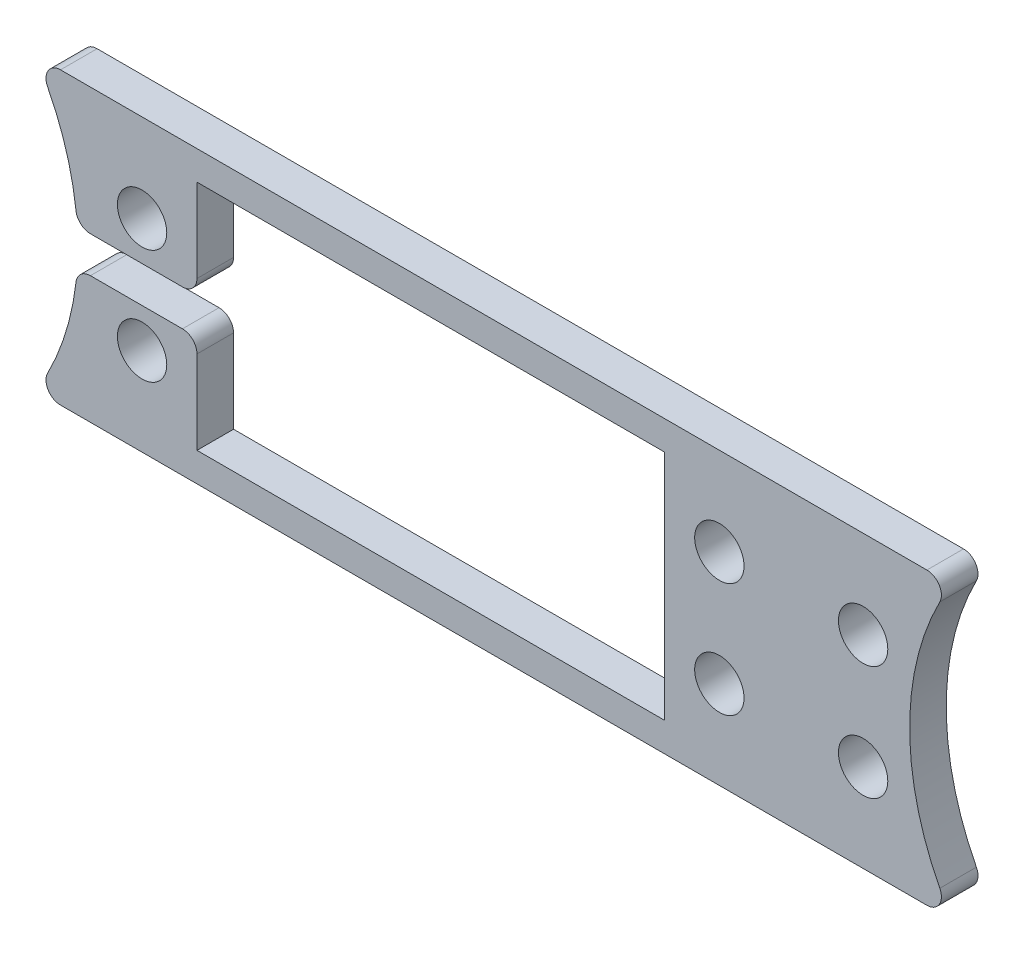
ISO-10303-21;
HEADER;
FILE_DESCRIPTION(('STEP AP214'),'2;1');
FILE_NAME('part.step','',(''),(''),'','','');
FILE_SCHEMA(('AUTOMOTIVE_DESIGN { 1 0 10303 214 1 1 1 1 }'));
ENDSEC;
DATA;
#1=APPLICATION_CONTEXT('core data for automotive mechanical design processes');
#2=APPLICATION_PROTOCOL_DEFINITION('international standard','automotive_design',2000,#1);
#3=PRODUCT_CONTEXT('',#1,'mechanical');
#4=PRODUCT('Part','Part','',(#3));
#5=PRODUCT_RELATED_PRODUCT_CATEGORY('part','',(#4));
#6=PRODUCT_DEFINITION_FORMATION('','',#4);
#7=PRODUCT_DEFINITION_CONTEXT('part definition',#1,'design');
#8=PRODUCT_DEFINITION('design','',#6,#7);
#9=PRODUCT_DEFINITION_SHAPE('','',#8);
#10=(LENGTH_UNIT() NAMED_UNIT(*) SI_UNIT(.MILLI.,.METRE.));
#11=(NAMED_UNIT(*) PLANE_ANGLE_UNIT() SI_UNIT($,.RADIAN.));
#12=(NAMED_UNIT(*) SI_UNIT($,.STERADIAN.) SOLID_ANGLE_UNIT());
#13=UNCERTAINTY_MEASURE_WITH_UNIT(LENGTH_MEASURE(1.E-05),#10,'distance_accuracy_value','');
#14=(GEOMETRIC_REPRESENTATION_CONTEXT(3) GLOBAL_UNCERTAINTY_ASSIGNED_CONTEXT((#13)) GLOBAL_UNIT_ASSIGNED_CONTEXT((#10,
#11,#12)) REPRESENTATION_CONTEXT('',''));
#15=CARTESIAN_POINT('',(0.,0.,0.));
#16=DIRECTION('',(0.,0.,1.));
#17=DIRECTION('',(1.,0.,0.));
#18=AXIS2_PLACEMENT_3D('',#15,#16,#17);
#19=CARTESIAN_POINT('',(-19.9175521588372,12.7,3.2004));
#20=DIRECTION('',(0.,0.,-1.));
#21=DIRECTION('',(-1.,0.,0.));
#22=AXIS2_PLACEMENT_3D('',#19,#20,#21);
#23=CYLINDRICAL_SURFACE('',#22,23.622);
#24=CARTESIAN_POINT('',(-19.9175521588372,12.7,0.));
#25=DIRECTION('',(0.,0.,-1.));
#26=DIRECTION('',(-1.,0.,0.));
#27=AXIS2_PLACEMENT_3D('',#24,#25,#26);
#28=CIRCLE('',#27,23.622);
#29=CARTESIAN_POINT('',(1.06684720952442,23.5468367346939,0.));
#30=VERTEX_POINT('',#29);
#31=CARTESIAN_POINT('',(3.54828507965018,15.4117091836735,0.));
#32=VERTEX_POINT('',#31);
#33=EDGE_CURVE('E236',#30,#32,#28,.T.);
#34=ORIENTED_EDGE('',*,*,#33,.T.);
#35=DIRECTION('',(0.,0.,-1.));
#36=VECTOR('',#35,1.);
#37=CARTESIAN_POINT('',(3.54828507965018,15.4117091836735,3.2004));
#38=LINE('',#37,#36);
#39=CARTESIAN_POINT('',(3.54828507965018,15.4117091836735,3.2004));
#40=VERTEX_POINT('',#39);
#41=EDGE_CURVE('E296',#32,#40,#38,.F.);
#42=ORIENTED_EDGE('',*,*,#41,.T.);
#43=CARTESIAN_POINT('',(-19.9175521588372,12.7,3.2004));
#44=DIRECTION('',(0.,0.,-1.));
#45=DIRECTION('',(-1.,0.,0.));
#46=AXIS2_PLACEMENT_3D('',#43,#44,#45);
#47=CIRCLE('',#46,23.622);
#48=CARTESIAN_POINT('',(1.06684720952442,23.5468367346939,3.2004));
#49=VERTEX_POINT('',#48);
#50=EDGE_CURVE('E222',#49,#40,#47,.T.);
#51=ORIENTED_EDGE('',*,*,#50,.F.);
#52=DIRECTION('',(0.,0.,-1.));
#53=VECTOR('',#52,1.);
#54=CARTESIAN_POINT('',(1.06684720952442,23.5468367346939,3.2004));
#55=LINE('',#54,#53);
#56=EDGE_CURVE('E293',#49,#30,#55,.T.);
#57=ORIENTED_EDGE('',*,*,#56,.T.);
#58=EDGE_LOOP('',(#34,#42,#51,#57));
#59=FACE_BOUND('',#58,.T.);
#60=ADVANCED_FACE('F33',(#59),#23,.F.);
#61=CARTESIAN_POINT('',(14.1324478131628,22.86,3.2004));
#62=DIRECTION('',(1.,0.,0.));
#63=DIRECTION('',(0.,1.,0.));
#64=AXIS2_PLACEMENT_3D('',#61,#62,#63);
#65=PLANE('',#64);
#66=DIRECTION('',(0.,-1.,0.));
#67=VECTOR('',#66,1.);
#68=CARTESIAN_POINT('',(14.1324478131628,22.86,0.));
#69=LINE('',#68,#67);
#70=CARTESIAN_POINT('',(14.1324478131628,9.84250000000004,0.));
#71=VERTEX_POINT('',#70);
#72=CARTESIAN_POINT('',(14.1324478131628,2.54000000000007,0.));
#73=VERTEX_POINT('',#72);
#74=EDGE_CURVE('E210',#71,#73,#69,.T.);
#75=ORIENTED_EDGE('',*,*,#74,.F.);
#76=DIRECTION('',(0.,0.,1.));
#77=VECTOR('',#76,1.);
#78=CARTESIAN_POINT('',(14.1324478131628,9.84250000000004,3.2004));
#79=LINE('',#78,#77);
#80=CARTESIAN_POINT('',(14.1324478131628,9.84250000000004,3.2004));
#81=VERTEX_POINT('',#80);
#82=EDGE_CURVE('E178',#71,#81,#79,.T.);
#83=ORIENTED_EDGE('',*,*,#82,.T.);
#84=DIRECTION('',(0.,-1.,0.));
#85=VECTOR('',#84,1.);
#86=CARTESIAN_POINT('',(14.1324478131628,22.86,3.2004));
#87=LINE('',#86,#85);
#88=CARTESIAN_POINT('',(14.1324478131628,2.54000000000007,3.2004));
#89=VERTEX_POINT('',#88);
#90=EDGE_CURVE('E172',#81,#89,#87,.T.);
#91=ORIENTED_EDGE('',*,*,#90,.T.);
#92=DIRECTION('',(0.,0.,-1.));
#93=VECTOR('',#92,1.);
#94=CARTESIAN_POINT('',(14.1324478131628,2.54000000000007,3.2004));
#95=LINE('',#94,#93);
#96=EDGE_CURVE('E176',#89,#73,#95,.T.);
#97=ORIENTED_EDGE('',*,*,#96,.T.);
#98=EDGE_LOOP('',(#75,#83,#91,#97));
#99=FACE_BOUND('',#98,.T.);
#100=ADVANCED_FACE('F175',(#99),#65,.T.);
#101=CARTESIAN_POINT('',(-19.9175521588372,12.7,3.2004));
#102=DIRECTION('',(0.,0.,-1.));
#103=DIRECTION('',(-1.,0.,0.));
#104=AXIS2_PLACEMENT_3D('',#101,#102,#103);
#105=PLANE('',#104);
#106=CARTESIAN_POINT('',(59.8294478131628,17.7,3.2004));
#107=DIRECTION('',(0.,0.,1.));
#108=DIRECTION('',(1.,0.,0.));
#109=AXIS2_PLACEMENT_3D('',#106,#107,#108);
#110=CIRCLE('',#109,2.15899999999999);
#111=CARTESIAN_POINT('',(61.9884478131628,17.7,3.2004));
#112=VERTEX_POINT('',#111);
#113=EDGE_CURVE('E362',#112,#112,#110,.T.);
#114=ORIENTED_EDGE('',*,*,#113,.F.);
#115=EDGE_LOOP('',(#114));
#116=FACE_BOUND('',#115,.T.);
#117=CARTESIAN_POINT('',(59.8294478131628,7.70000000000003,3.2004));
#118=DIRECTION('',(0.,0.,1.));
#119=DIRECTION('',(1.,0.,0.));
#120=AXIS2_PLACEMENT_3D('',#117,#118,#119);
#121=CIRCLE('',#120,2.15899999999999);
#122=CARTESIAN_POINT('',(61.9884478131628,7.70000000000003,3.2004));
#123=VERTEX_POINT('',#122);
#124=EDGE_CURVE('E363',#123,#123,#121,.T.);
#125=ORIENTED_EDGE('',*,*,#124,.F.);
#126=EDGE_LOOP('',(#125));
#127=FACE_BOUND('',#126,.T.);
#128=CARTESIAN_POINT('',(9.3294478131628,17.7,3.2004));
#129=DIRECTION('',(0.,0.,1.));
#130=DIRECTION('',(1.,0.,0.));
#131=AXIS2_PLACEMENT_3D('',#128,#129,#130);
#132=CIRCLE('',#131,2.159);
#133=CARTESIAN_POINT('',(11.4884478131628,17.7,3.2004));
#134=VERTEX_POINT('',#133);
#135=EDGE_CURVE('E370',#134,#134,#132,.T.);
#136=ORIENTED_EDGE('',*,*,#135,.F.);
#137=EDGE_LOOP('',(#136));
#138=FACE_BOUND('',#137,.T.);
#139=CARTESIAN_POINT('',(72.4046881872468,7.70000000000003,3.2004));
#140=DIRECTION('',(0.,0.,1.));
#141=DIRECTION('',(1.,0.,0.));
#142=AXIS2_PLACEMENT_3D('',#139,#140,#141);
#143=CIRCLE('',#142,2.15899999999999);
#144=CARTESIAN_POINT('',(74.5636881872468,7.70000000000003,3.2004));
#145=VERTEX_POINT('',#144);
#146=EDGE_CURVE('E375',#145,#145,#143,.T.);
#147=ORIENTED_EDGE('',*,*,#146,.F.);
#148=EDGE_LOOP('',(#147));
#149=FACE_BOUND('',#148,.T.);
#150=CARTESIAN_POINT('',(9.3294478131628,7.70000000000002,3.2004));
#151=DIRECTION('',(0.,0.,1.));
#152=DIRECTION('',(1.,0.,0.));
#153=AXIS2_PLACEMENT_3D('',#150,#151,#152);
#154=CIRCLE('',#153,2.159);
#155=CARTESIAN_POINT('',(11.4884478131628,7.70000000000002,3.2004));
#156=VERTEX_POINT('',#155);
#157=EDGE_CURVE('E352',#156,#156,#154,.T.);
#158=ORIENTED_EDGE('',*,*,#157,.F.);
#159=EDGE_LOOP('',(#158));
#160=FACE_BOUND('',#159,.T.);
#161=CARTESIAN_POINT('',(72.4046881872468,17.7,3.2004));
#162=DIRECTION('',(0.,0.,1.));
#163=DIRECTION('',(1.,0.,0.));
#164=AXIS2_PLACEMENT_3D('',#161,#162,#163);
#165=CIRCLE('',#164,2.15899999999999);
#166=CARTESIAN_POINT('',(74.5636881872468,17.7,3.2004));
#167=VERTEX_POINT('',#166);
#168=EDGE_CURVE('E382',#167,#167,#165,.T.);
#169=ORIENTED_EDGE('',*,*,#168,.F.);
#170=EDGE_LOOP('',(#169));
#171=FACE_BOUND('',#170,.T.);
#172=ORIENTED_EDGE('',*,*,#90,.F.);
#173=CARTESIAN_POINT('',(12.8624478131628,9.84250000000004,3.2004));
#174=DIRECTION('',(0.,0.,-1.));
#175=DIRECTION('',(-1.,0.,0.));
#176=AXIS2_PLACEMENT_3D('',#173,#174,#175);
#177=CIRCLE('',#176,1.27);
#178=CARTESIAN_POINT('',(12.8624478131628,11.1125,3.2004));
#179=VERTEX_POINT('',#178);
#180=EDGE_CURVE('E261',#81,#179,#177,.F.);
#181=ORIENTED_EDGE('',*,*,#180,.T.);
#182=DIRECTION('',(1.,0.,0.));
#183=VECTOR('',#182,1.);
#184=CARTESIAN_POINT('',(3.6510440604967,11.1125,3.2004));
#185=LINE('',#184,#183);
#186=CARTESIAN_POINT('',(4.80988923225703,11.1125,3.2004));
#187=VERTEX_POINT('',#186);
#188=EDGE_CURVE('E346',#187,#179,#185,.T.);
#189=ORIENTED_EDGE('',*,*,#188,.F.);
#190=CARTESIAN_POINT('',(4.80988923225704,9.84250000000002,3.2004));
#191=DIRECTION('',(0.,0.,-1.));
#192=DIRECTION('',(-1.,0.,0.));
#193=AXIS2_PLACEMENT_3D('',#190,#191,#192);
#194=CIRCLE('',#193,1.27);
#195=CARTESIAN_POINT('',(3.54828507965019,9.98829081632655,3.2004));
#196=VERTEX_POINT('',#195);
#197=EDGE_CURVE('E257',#187,#196,#194,.F.);
#198=ORIENTED_EDGE('',*,*,#197,.T.);
#199=CARTESIAN_POINT('',(1.06684720952444,1.85316326530612,3.2004));
#200=VERTEX_POINT('',#199);
#201=EDGE_CURVE('E226',#196,#200,#47,.T.);
#202=ORIENTED_EDGE('',*,*,#201,.T.);
#203=CARTESIAN_POINT('',(2.19504072395248,1.27,3.2004));
#204=DIRECTION('',(0.,0.,-1.));
#205=DIRECTION('',(-1.,0.,0.));
#206=AXIS2_PLACEMENT_3D('',#203,#204,#205);
#207=CIRCLE('',#206,1.27);
#208=CARTESIAN_POINT('',(2.19504072395248,0.,3.2004));
#209=VERTEX_POINT('',#208);
#210=EDGE_CURVE('E253',#200,#209,#207,.F.);
#211=ORIENTED_EDGE('',*,*,#210,.T.);
#212=DIRECTION('',(1.,0.,0.));
#213=VECTOR('',#212,1.);
#214=CARTESIAN_POINT('',(0.,0.,3.2004));
#215=LINE('',#214,#213);
#216=CARTESIAN_POINT('',(77.9848549583731,0.,3.2004));
#217=VERTEX_POINT('',#216);
#218=EDGE_CURVE('E225',#209,#217,#215,.T.);
#219=ORIENTED_EDGE('',*,*,#218,.T.);
#220=CARTESIAN_POINT('',(77.9848549583731,1.27000000000002,3.2004));
#221=DIRECTION('',(0.,0.,-1.));
#222=DIRECTION('',(-1.,0.,0.));
#223=AXIS2_PLACEMENT_3D('',#220,#221,#222);
#224=CIRCLE('',#223,1.27);
#225=CARTESIAN_POINT('',(79.1130484728012,1.85316326530614,3.2004));
#226=VERTEX_POINT('',#225);
#227=EDGE_CURVE('E249',#217,#226,#224,.F.);
#228=ORIENTED_EDGE('',*,*,#227,.T.);
#229=CARTESIAN_POINT('',(100.097447841163,12.7,3.2004));
#230=DIRECTION('',(0.,0.,-1.));
#231=DIRECTION('',(-1.,0.,0.));
#232=AXIS2_PLACEMENT_3D('',#229,#230,#231);
#233=CIRCLE('',#232,23.622);
#234=CARTESIAN_POINT('',(79.1130484728012,23.5468367346939,3.2004));
#235=VERTEX_POINT('',#234);
#236=EDGE_CURVE('E229',#226,#235,#233,.T.);
#237=ORIENTED_EDGE('',*,*,#236,.T.);
#238=CARTESIAN_POINT('',(77.9848549583731,24.13,3.2004));
#239=DIRECTION('',(0.,0.,-1.));
#240=DIRECTION('',(-1.,0.,0.));
#241=AXIS2_PLACEMENT_3D('',#238,#239,#240);
#242=CIRCLE('',#241,1.27);
#243=CARTESIAN_POINT('',(77.9848549583731,25.4,3.2004));
#244=VERTEX_POINT('',#243);
#245=EDGE_CURVE('E247',#235,#244,#242,.F.);
#246=ORIENTED_EDGE('',*,*,#245,.T.);
#247=DIRECTION('',(-1.,0.,0.));
#248=VECTOR('',#247,1.);
#249=CARTESIAN_POINT('',(0.,25.4,3.2004));
#250=LINE('',#249,#248);
#251=CARTESIAN_POINT('',(2.19504072395246,25.4,3.2004));
#252=VERTEX_POINT('',#251);
#253=EDGE_CURVE('E232',#244,#252,#250,.T.);
#254=ORIENTED_EDGE('',*,*,#253,.T.);
#255=CARTESIAN_POINT('',(2.19504072395246,24.13,3.2004));
#256=DIRECTION('',(0.,0.,-1.));
#257=DIRECTION('',(-1.,0.,0.));
#258=AXIS2_PLACEMENT_3D('',#255,#256,#257);
#259=CIRCLE('',#258,1.27);
#260=EDGE_CURVE('E251',#252,#49,#259,.F.);
#261=ORIENTED_EDGE('',*,*,#260,.T.);
#262=ORIENTED_EDGE('',*,*,#50,.T.);
#263=CARTESIAN_POINT('',(4.80988923225703,15.5575,3.2004));
#264=DIRECTION('',(0.,0.,-1.));
#265=DIRECTION('',(-1.,0.,0.));
#266=AXIS2_PLACEMENT_3D('',#263,#264,#265);
#267=CIRCLE('',#266,1.27);
#268=CARTESIAN_POINT('',(4.80988923225703,14.2875,3.2004));
#269=VERTEX_POINT('',#268);
#270=EDGE_CURVE('E255',#40,#269,#267,.F.);
#271=ORIENTED_EDGE('',*,*,#270,.T.);
#272=DIRECTION('',(-1.,0.,0.));
#273=VECTOR('',#272,1.);
#274=CARTESIAN_POINT('',(3.6510440604967,14.2875,3.2004));
#275=LINE('',#274,#273);
#276=CARTESIAN_POINT('',(12.8624478131628,14.2875,3.2004));
#277=VERTEX_POINT('',#276);
#278=EDGE_CURVE('E337',#277,#269,#275,.T.);
#279=ORIENTED_EDGE('',*,*,#278,.F.);
#280=CARTESIAN_POINT('',(12.8624478131628,15.5575,3.2004));
#281=DIRECTION('',(0.,0.,-1.));
#282=DIRECTION('',(-1.,0.,0.));
#283=AXIS2_PLACEMENT_3D('',#280,#281,#282);
#284=CIRCLE('',#283,1.27);
#285=CARTESIAN_POINT('',(14.1324478131628,15.5575,3.2004));
#286=VERTEX_POINT('',#285);
#287=EDGE_CURVE('E259',#277,#286,#284,.F.);
#288=ORIENTED_EDGE('',*,*,#287,.T.);
#289=CARTESIAN_POINT('',(14.1324478131628,22.86,3.2004));
#290=VERTEX_POINT('',#289);
#291=EDGE_CURVE('E181',#290,#286,#87,.T.);
#292=ORIENTED_EDGE('',*,*,#291,.F.);
#293=DIRECTION('',(-1.,0.,0.));
#294=VECTOR('',#293,1.);
#295=CARTESIAN_POINT('',(14.1324478131628,22.86,3.2004));
#296=LINE('',#295,#294);
#297=CARTESIAN_POINT('',(55.0264478131628,22.86,3.2004));
#298=VERTEX_POINT('',#297);
#299=EDGE_CURVE('E200',#298,#290,#296,.T.);
#300=ORIENTED_EDGE('',*,*,#299,.F.);
#301=DIRECTION('',(0.,1.,0.));
#302=VECTOR('',#301,1.);
#303=CARTESIAN_POINT('',(55.0264478131628,22.86,3.2004));
#304=LINE('',#303,#302);
#305=CARTESIAN_POINT('',(55.0264478131628,2.54000000000008,3.2004));
#306=VERTEX_POINT('',#305);
#307=EDGE_CURVE('E198',#306,#298,#304,.T.);
#308=ORIENTED_EDGE('',*,*,#307,.F.);
#309=DIRECTION('',(1.,0.,0.));
#310=VECTOR('',#309,1.);
#311=CARTESIAN_POINT('',(14.1324478131628,2.54000000000007,3.2004));
#312=LINE('',#311,#310);
#313=EDGE_CURVE('E187',#89,#306,#312,.T.);
#314=ORIENTED_EDGE('',*,*,#313,.F.);
#315=EDGE_LOOP('',(#172,#181,#189,#198,#202,#211,#219,#228,#237,#246,#254,#261,#262,#271,#279,
#288,#292,#300,#308,#314));
#316=FACE_BOUND('',#315,.T.);
#317=ADVANCED_FACE('F195',(#116,#127,#138,#149,#160,#171,#316),#105,.F.);
#318=CARTESIAN_POINT('',(-19.9175521588372,12.7,0.));
#319=DIRECTION('',(0.,0.,-1.));
#320=DIRECTION('',(-1.,0.,0.));
#321=AXIS2_PLACEMENT_3D('',#318,#319,#320);
#322=PLANE('',#321);
#323=DIRECTION('',(1.,0.,0.));
#324=VECTOR('',#323,1.);
#325=CARTESIAN_POINT('',(3.6510440604967,11.1125,0.));
#326=LINE('',#325,#324);
#327=CARTESIAN_POINT('',(4.80988923225704,11.1125,0.));
#328=VERTEX_POINT('',#327);
#329=CARTESIAN_POINT('',(12.8624478131628,11.1125,0.));
#330=VERTEX_POINT('',#329);
#331=EDGE_CURVE('E345',#328,#330,#326,.T.);
#332=ORIENTED_EDGE('',*,*,#331,.T.);
#333=CARTESIAN_POINT('',(12.8624478131628,9.84250000000004,0.));
#334=DIRECTION('',(0.,0.,-1.));
#335=DIRECTION('',(-1.,0.,0.));
#336=AXIS2_PLACEMENT_3D('',#333,#334,#335);
#337=CIRCLE('',#336,1.27);
#338=EDGE_CURVE('E281',#330,#71,#337,.T.);
#339=ORIENTED_EDGE('',*,*,#338,.T.);
#340=ORIENTED_EDGE('',*,*,#74,.T.);
#341=DIRECTION('',(1.,0.,0.));
#342=VECTOR('',#341,1.);
#343=CARTESIAN_POINT('',(14.1324478131628,2.54000000000007,0.));
#344=LINE('',#343,#342);
#345=CARTESIAN_POINT('',(55.0264478131628,2.54000000000008,0.));
#346=VERTEX_POINT('',#345);
#347=EDGE_CURVE('E190',#73,#346,#344,.T.);
#348=ORIENTED_EDGE('',*,*,#347,.T.);
#349=DIRECTION('',(0.,1.,0.));
#350=VECTOR('',#349,1.);
#351=CARTESIAN_POINT('',(55.0264478131628,22.86,0.));
#352=LINE('',#351,#350);
#353=CARTESIAN_POINT('',(55.0264478131628,22.86,0.));
#354=VERTEX_POINT('',#353);
#355=EDGE_CURVE('E212',#346,#354,#352,.T.);
#356=ORIENTED_EDGE('',*,*,#355,.T.);
#357=DIRECTION('',(-1.,0.,0.));
#358=VECTOR('',#357,1.);
#359=CARTESIAN_POINT('',(14.1324478131628,22.86,0.));
#360=LINE('',#359,#358);
#361=CARTESIAN_POINT('',(14.1324478131628,22.86,0.));
#362=VERTEX_POINT('',#361);
#363=EDGE_CURVE('E182',#354,#362,#360,.T.);
#364=ORIENTED_EDGE('',*,*,#363,.T.);
#365=CARTESIAN_POINT('',(14.1324478131628,15.5575,0.));
#366=VERTEX_POINT('',#365);
#367=EDGE_CURVE('E207',#362,#366,#69,.T.);
#368=ORIENTED_EDGE('',*,*,#367,.T.);
#369=CARTESIAN_POINT('',(12.8624478131628,15.5575,0.));
#370=DIRECTION('',(0.,0.,-1.));
#371=DIRECTION('',(-1.,0.,0.));
#372=AXIS2_PLACEMENT_3D('',#369,#370,#371);
#373=CIRCLE('',#372,1.27);
#374=CARTESIAN_POINT('',(12.8624478131628,14.2875,0.));
#375=VERTEX_POINT('',#374);
#376=EDGE_CURVE('E279',#366,#375,#373,.T.);
#377=ORIENTED_EDGE('',*,*,#376,.T.);
#378=DIRECTION('',(-1.,0.,0.));
#379=VECTOR('',#378,1.);
#380=CARTESIAN_POINT('',(3.6510440604967,14.2875,0.));
#381=LINE('',#380,#379);
#382=CARTESIAN_POINT('',(4.80988923225703,14.2875,0.));
#383=VERTEX_POINT('',#382);
#384=EDGE_CURVE('E350',#375,#383,#381,.T.);
#385=ORIENTED_EDGE('',*,*,#384,.T.);
#386=CARTESIAN_POINT('',(4.80988923225703,15.5575,0.));
#387=DIRECTION('',(0.,0.,-1.));
#388=DIRECTION('',(-1.,0.,0.));
#389=AXIS2_PLACEMENT_3D('',#386,#387,#388);
#390=CIRCLE('',#389,1.27);
#391=EDGE_CURVE('E275',#383,#32,#390,.T.);
#392=ORIENTED_EDGE('',*,*,#391,.T.);
#393=ORIENTED_EDGE('',*,*,#33,.F.);
#394=CARTESIAN_POINT('',(2.19504072395246,24.13,0.));
#395=DIRECTION('',(0.,0.,-1.));
#396=DIRECTION('',(-1.,0.,0.));
#397=AXIS2_PLACEMENT_3D('',#394,#395,#396);
#398=CIRCLE('',#397,1.27);
#399=CARTESIAN_POINT('',(2.19504072395246,25.4,0.));
#400=VERTEX_POINT('',#399);
#401=EDGE_CURVE('E272',#30,#400,#398,.T.);
#402=ORIENTED_EDGE('',*,*,#401,.T.);
#403=DIRECTION('',(-1.,0.,0.));
#404=VECTOR('',#403,1.);
#405=CARTESIAN_POINT('',(0.,25.4,0.));
#406=LINE('',#405,#404);
#407=CARTESIAN_POINT('',(77.9848549583731,25.4,0.));
#408=VERTEX_POINT('',#407);
#409=EDGE_CURVE('E243',#408,#400,#406,.T.);
#410=ORIENTED_EDGE('',*,*,#409,.F.);
#411=CARTESIAN_POINT('',(77.9848549583731,24.13,0.));
#412=DIRECTION('',(0.,0.,-1.));
#413=DIRECTION('',(-1.,0.,0.));
#414=AXIS2_PLACEMENT_3D('',#411,#412,#413);
#415=CIRCLE('',#414,1.27);
#416=CARTESIAN_POINT('',(79.1130484728012,23.5468367346939,0.));
#417=VERTEX_POINT('',#416);
#418=EDGE_CURVE('E268',#408,#417,#415,.T.);
#419=ORIENTED_EDGE('',*,*,#418,.T.);
#420=CARTESIAN_POINT('',(100.097447841163,12.7,0.));
#421=DIRECTION('',(0.,0.,-1.));
#422=DIRECTION('',(-1.,0.,0.));
#423=AXIS2_PLACEMENT_3D('',#420,#421,#422);
#424=CIRCLE('',#423,23.622);
#425=CARTESIAN_POINT('',(79.1130484728012,1.85316326530614,0.));
#426=VERTEX_POINT('',#425);
#427=EDGE_CURVE('E240',#426,#417,#424,.T.);
#428=ORIENTED_EDGE('',*,*,#427,.F.);
#429=CARTESIAN_POINT('',(77.9848549583731,1.27000000000002,0.));
#430=DIRECTION('',(0.,0.,-1.));
#431=DIRECTION('',(-1.,0.,0.));
#432=AXIS2_PLACEMENT_3D('',#429,#430,#431);
#433=CIRCLE('',#432,1.27);
#434=CARTESIAN_POINT('',(77.9848549583731,0.,0.));
#435=VERTEX_POINT('',#434);
#436=EDGE_CURVE('E270',#426,#435,#433,.T.);
#437=ORIENTED_EDGE('',*,*,#436,.T.);
#438=DIRECTION('',(1.,0.,0.));
#439=VECTOR('',#438,1.);
#440=CARTESIAN_POINT('',(0.,0.,0.));
#441=LINE('',#440,#439);
#442=CARTESIAN_POINT('',(2.19504072395248,0.,0.));
#443=VERTEX_POINT('',#442);
#444=EDGE_CURVE('E237',#443,#435,#441,.T.);
#445=ORIENTED_EDGE('',*,*,#444,.F.);
#446=CARTESIAN_POINT('',(2.19504072395248,1.27,0.));
#447=DIRECTION('',(0.,0.,-1.));
#448=DIRECTION('',(-1.,0.,0.));
#449=AXIS2_PLACEMENT_3D('',#446,#447,#448);
#450=CIRCLE('',#449,1.27);
#451=CARTESIAN_POINT('',(1.06684720952444,1.85316326530612,0.));
#452=VERTEX_POINT('',#451);
#453=EDGE_CURVE('E48',#443,#452,#450,.T.);
#454=ORIENTED_EDGE('',*,*,#453,.T.);
#455=CARTESIAN_POINT('',(3.54828507965019,9.98829081632655,0.));
#456=VERTEX_POINT('',#455);
#457=EDGE_CURVE('E191',#456,#452,#28,.T.);
#458=ORIENTED_EDGE('',*,*,#457,.F.);
#459=CARTESIAN_POINT('',(4.80988923225704,9.84250000000002,0.));
#460=DIRECTION('',(0.,0.,-1.));
#461=DIRECTION('',(-1.,0.,0.));
#462=AXIS2_PLACEMENT_3D('',#459,#460,#461);
#463=CIRCLE('',#462,1.27);
#464=EDGE_CURVE('E277',#456,#328,#463,.T.);
#465=ORIENTED_EDGE('',*,*,#464,.T.);
#466=EDGE_LOOP('',(#332,#339,#340,#348,#356,#364,#368,#377,#385,#392,#393,#402,#410,#419,#428,
#437,#445,#454,#458,#465));
#467=FACE_BOUND('',#466,.T.);
#468=CARTESIAN_POINT('',(59.8294478131628,17.7,0.));
#469=DIRECTION('',(0.,0.,-1.));
#470=DIRECTION('',(-1.,0.,0.));
#471=AXIS2_PLACEMENT_3D('',#468,#469,#470);
#472=CIRCLE('',#471,2.15899999999999);
#473=CARTESIAN_POINT('',(57.6704478131628,17.7,0.));
#474=VERTEX_POINT('',#473);
#475=EDGE_CURVE('E367',#474,#474,#472,.F.);
#476=ORIENTED_EDGE('',*,*,#475,.T.);
#477=EDGE_LOOP('',(#476));
#478=FACE_BOUND('',#477,.T.);
#479=CARTESIAN_POINT('',(59.8294478131628,7.70000000000003,0.));
#480=DIRECTION('',(0.,0.,-1.));
#481=DIRECTION('',(-1.,0.,0.));
#482=AXIS2_PLACEMENT_3D('',#479,#480,#481);
#483=CIRCLE('',#482,2.15899999999999);
#484=CARTESIAN_POINT('',(57.6704478131628,7.70000000000003,0.));
#485=VERTEX_POINT('',#484);
#486=EDGE_CURVE('E366',#485,#485,#483,.F.);
#487=ORIENTED_EDGE('',*,*,#486,.T.);
#488=EDGE_LOOP('',(#487));
#489=FACE_BOUND('',#488,.T.);
#490=CARTESIAN_POINT('',(9.3294478131628,17.7,0.));
#491=DIRECTION('',(0.,0.,-1.));
#492=DIRECTION('',(-1.,0.,0.));
#493=AXIS2_PLACEMENT_3D('',#490,#491,#492);
#494=CIRCLE('',#493,2.159);
#495=CARTESIAN_POINT('',(7.17044781316279,17.7,0.));
#496=VERTEX_POINT('',#495);
#497=EDGE_CURVE('E379',#496,#496,#494,.F.);
#498=ORIENTED_EDGE('',*,*,#497,.T.);
#499=EDGE_LOOP('',(#498));
#500=FACE_BOUND('',#499,.T.);
#501=CARTESIAN_POINT('',(72.4046881872468,7.70000000000003,0.));
#502=DIRECTION('',(0.,0.,-1.));
#503=DIRECTION('',(-1.,0.,0.));
#504=AXIS2_PLACEMENT_3D('',#501,#502,#503);
#505=CIRCLE('',#504,2.15899999999999);
#506=CARTESIAN_POINT('',(70.2456881872469,7.70000000000003,0.));
#507=VERTEX_POINT('',#506);
#508=EDGE_CURVE('E378',#507,#507,#505,.F.);
#509=ORIENTED_EDGE('',*,*,#508,.T.);
#510=EDGE_LOOP('',(#509));
#511=FACE_BOUND('',#510,.T.);
#512=CARTESIAN_POINT('',(9.3294478131628,7.70000000000002,0.));
#513=DIRECTION('',(0.,0.,-1.));
#514=DIRECTION('',(-1.,0.,0.));
#515=AXIS2_PLACEMENT_3D('',#512,#513,#514);
#516=CIRCLE('',#515,2.159);
#517=CARTESIAN_POINT('',(7.1704478131628,7.70000000000002,0.));
#518=VERTEX_POINT('',#517);
#519=EDGE_CURVE('E355',#518,#518,#516,.F.);
#520=ORIENTED_EDGE('',*,*,#519,.T.);
#521=EDGE_LOOP('',(#520));
#522=FACE_BOUND('',#521,.T.);
#523=CARTESIAN_POINT('',(72.4046881872468,17.7,0.));
#524=DIRECTION('',(0.,0.,-1.));
#525=DIRECTION('',(-1.,0.,0.));
#526=AXIS2_PLACEMENT_3D('',#523,#524,#525);
#527=CIRCLE('',#526,2.15899999999999);
#528=CARTESIAN_POINT('',(70.2456881872469,17.7,0.));
#529=VERTEX_POINT('',#528);
#530=EDGE_CURVE('E388',#529,#529,#527,.F.);
#531=ORIENTED_EDGE('',*,*,#530,.T.);
#532=EDGE_LOOP('',(#531));
#533=FACE_BOUND('',#532,.T.);
#534=ADVANCED_FACE('F324',(#467,#478,#489,#500,#511,#522,#533),#322,.T.);
#535=ORIENTED_EDGE('',*,*,#201,.F.);
#536=DIRECTION('',(0.,0.,-1.));
#537=VECTOR('',#536,1.);
#538=CARTESIAN_POINT('',(3.54828507965019,9.98829081632655,3.2004));
#539=LINE('',#538,#537);
#540=EDGE_CURVE('E55',#196,#456,#539,.T.);
#541=ORIENTED_EDGE('',*,*,#540,.T.);
#542=ORIENTED_EDGE('',*,*,#457,.T.);
#543=DIRECTION('',(0.,0.,-1.));
#544=VECTOR('',#543,1.);
#545=CARTESIAN_POINT('',(1.06684720952444,1.85316326530612,3.2004));
#546=LINE('',#545,#544);
#547=EDGE_CURVE('E290',#452,#200,#546,.F.);
#548=ORIENTED_EDGE('',*,*,#547,.T.);
#549=EDGE_LOOP('',(#535,#541,#542,#548));
#550=FACE_BOUND('',#549,.T.);
#551=ADVANCED_FACE('F407',(#550),#23,.F.);
#552=CARTESIAN_POINT('',(0.,0.,3.2004));
#553=DIRECTION('',(0.,1.,0.));
#554=DIRECTION('',(-1.,0.,0.));
#555=AXIS2_PLACEMENT_3D('',#552,#553,#554);
#556=PLANE('',#555);
#557=ORIENTED_EDGE('',*,*,#218,.F.);
#558=DIRECTION('',(0.,0.,-1.));
#559=VECTOR('',#558,1.);
#560=CARTESIAN_POINT('',(2.19504072395248,0.,3.2004));
#561=LINE('',#560,#559);
#562=EDGE_CURVE('E301',#209,#443,#561,.T.);
#563=ORIENTED_EDGE('',*,*,#562,.T.);
#564=ORIENTED_EDGE('',*,*,#444,.T.);
#565=DIRECTION('',(0.,0.,-1.));
#566=VECTOR('',#565,1.);
#567=CARTESIAN_POINT('',(77.9848549583731,0.,3.2004));
#568=LINE('',#567,#566);
#569=EDGE_CURVE('E299',#435,#217,#568,.F.);
#570=ORIENTED_EDGE('',*,*,#569,.T.);
#571=EDGE_LOOP('',(#557,#563,#564,#570));
#572=FACE_BOUND('',#571,.T.);
#573=ADVANCED_FACE('F414',(#572),#556,.F.);
#574=CARTESIAN_POINT('',(100.097447841163,12.7,3.2004));
#575=DIRECTION('',(0.,0.,-1.));
#576=DIRECTION('',(-1.,0.,0.));
#577=AXIS2_PLACEMENT_3D('',#574,#575,#576);
#578=CYLINDRICAL_SURFACE('',#577,23.622);
#579=ORIENTED_EDGE('',*,*,#236,.F.);
#580=DIRECTION('',(0.,0.,-1.));
#581=VECTOR('',#580,1.);
#582=CARTESIAN_POINT('',(79.1130484728012,1.85316326530614,3.2004));
#583=LINE('',#582,#581);
#584=EDGE_CURVE('E11',#226,#426,#583,.T.);
#585=ORIENTED_EDGE('',*,*,#584,.T.);
#586=ORIENTED_EDGE('',*,*,#427,.T.);
#587=DIRECTION('',(0.,0.,-1.));
#588=VECTOR('',#587,1.);
#589=CARTESIAN_POINT('',(79.1130484728012,23.5468367346939,3.2004));
#590=LINE('',#589,#588);
#591=EDGE_CURVE('E41',#417,#235,#590,.F.);
#592=ORIENTED_EDGE('',*,*,#591,.T.);
#593=EDGE_LOOP('',(#579,#585,#586,#592));
#594=FACE_BOUND('',#593,.T.);
#595=ADVANCED_FACE('F311',(#594),#578,.F.);
#596=CARTESIAN_POINT('',(0.,25.4,3.2004));
#597=DIRECTION('',(0.,-1.,0.));
#598=DIRECTION('',(1.,0.,0.));
#599=AXIS2_PLACEMENT_3D('',#596,#597,#598);
#600=PLANE('',#599);
#601=ORIENTED_EDGE('',*,*,#409,.T.);
#602=DIRECTION('',(0.,0.,-1.));
#603=VECTOR('',#602,1.);
#604=CARTESIAN_POINT('',(2.19504072395246,25.4,3.2004));
#605=LINE('',#604,#603);
#606=EDGE_CURVE('E307',#400,#252,#605,.F.);
#607=ORIENTED_EDGE('',*,*,#606,.T.);
#608=ORIENTED_EDGE('',*,*,#253,.F.);
#609=DIRECTION('',(0.,0.,-1.));
#610=VECTOR('',#609,1.);
#611=CARTESIAN_POINT('',(77.9848549583731,25.4,3.2004));
#612=LINE('',#611,#610);
#613=EDGE_CURVE('E304',#244,#408,#612,.T.);
#614=ORIENTED_EDGE('',*,*,#613,.T.);
#615=EDGE_LOOP('',(#601,#607,#608,#614));
#616=FACE_BOUND('',#615,.T.);
#617=ADVANCED_FACE('F321',(#616),#600,.F.);
#618=ORIENTED_EDGE('',*,*,#291,.T.);
#619=DIRECTION('',(0.,0.,1.));
#620=VECTOR('',#619,1.);
#621=CARTESIAN_POINT('',(14.1324478131628,15.5575,0.));
#622=LINE('',#621,#620);
#623=EDGE_CURVE('E288',#286,#366,#622,.F.);
#624=ORIENTED_EDGE('',*,*,#623,.T.);
#625=ORIENTED_EDGE('',*,*,#367,.F.);
#626=DIRECTION('',(0.,0.,-1.));
#627=VECTOR('',#626,1.);
#628=CARTESIAN_POINT('',(14.1324478131628,22.86,3.2004));
#629=LINE('',#628,#627);
#630=EDGE_CURVE('E206',#290,#362,#629,.T.);
#631=ORIENTED_EDGE('',*,*,#630,.F.);
#632=EDGE_LOOP('',(#618,#624,#625,#631));
#633=FACE_BOUND('',#632,.T.);
#634=ADVANCED_FACE('F430',(#633),#65,.T.);
#635=CARTESIAN_POINT('',(14.1324478131628,2.54000000000007,3.2004));
#636=DIRECTION('',(0.,1.,0.));
#637=DIRECTION('',(-1.,0.,0.));
#638=AXIS2_PLACEMENT_3D('',#635,#636,#637);
#639=PLANE('',#638);
#640=ORIENTED_EDGE('',*,*,#347,.F.);
#641=ORIENTED_EDGE('',*,*,#96,.F.);
#642=ORIENTED_EDGE('',*,*,#313,.T.);
#643=DIRECTION('',(0.,0.,-1.));
#644=VECTOR('',#643,1.);
#645=CARTESIAN_POINT('',(55.0264478131628,2.54000000000008,3.2004));
#646=LINE('',#645,#644);
#647=EDGE_CURVE('E192',#306,#346,#646,.T.);
#648=ORIENTED_EDGE('',*,*,#647,.T.);
#649=EDGE_LOOP('',(#640,#641,#642,#648));
#650=FACE_BOUND('',#649,.T.);
#651=ADVANCED_FACE('F186',(#650),#639,.T.);
#652=CARTESIAN_POINT('',(55.0264478131628,22.86,3.2004));
#653=DIRECTION('',(-1.,0.,0.));
#654=DIRECTION('',(0.,-1.,0.));
#655=AXIS2_PLACEMENT_3D('',#652,#653,#654);
#656=PLANE('',#655);
#657=ORIENTED_EDGE('',*,*,#355,.F.);
#658=ORIENTED_EDGE('',*,*,#647,.F.);
#659=ORIENTED_EDGE('',*,*,#307,.T.);
#660=DIRECTION('',(0.,0.,-1.));
#661=VECTOR('',#660,1.);
#662=CARTESIAN_POINT('',(55.0264478131628,22.86,3.2004));
#663=LINE('',#662,#661);
#664=EDGE_CURVE('E219',#298,#354,#663,.T.);
#665=ORIENTED_EDGE('',*,*,#664,.T.);
#666=EDGE_LOOP('',(#657,#658,#659,#665));
#667=FACE_BOUND('',#666,.T.);
#668=ADVANCED_FACE('F469',(#667),#656,.T.);
#669=CARTESIAN_POINT('',(14.1324478131628,22.86,3.2004));
#670=DIRECTION('',(0.,-1.,0.));
#671=DIRECTION('',(1.,0.,0.));
#672=AXIS2_PLACEMENT_3D('',#669,#670,#671);
#673=PLANE('',#672);
#674=ORIENTED_EDGE('',*,*,#363,.F.);
#675=ORIENTED_EDGE('',*,*,#664,.F.);
#676=ORIENTED_EDGE('',*,*,#299,.T.);
#677=ORIENTED_EDGE('',*,*,#630,.T.);
#678=EDGE_LOOP('',(#674,#675,#676,#677));
#679=FACE_BOUND('',#678,.T.);
#680=ADVANCED_FACE('F476',(#679),#673,.T.);
#681=CARTESIAN_POINT('',(72.4046881872468,17.7,-6.10657416232703));
#682=DIRECTION('',(0.,0.,1.));
#683=DIRECTION('',(1.,0.,0.));
#684=AXIS2_PLACEMENT_3D('',#681,#682,#683);
#685=CYLINDRICAL_SURFACE('',#684,2.15899999999999);
#686=ORIENTED_EDGE('',*,*,#168,.T.);
#687=EDGE_LOOP('',(#686));
#688=FACE_BOUND('',#687,.T.);
#689=ORIENTED_EDGE('',*,*,#530,.F.);
#690=EDGE_LOOP('',(#689));
#691=FACE_BOUND('',#690,.T.);
#692=ADVANCED_FACE('F484',(#688,#691),#685,.F.);
#693=CARTESIAN_POINT('',(9.3294478131628,7.70000000000002,-6.10657416232703));
#694=DIRECTION('',(0.,0.,1.));
#695=DIRECTION('',(1.,0.,0.));
#696=AXIS2_PLACEMENT_3D('',#693,#694,#695);
#697=CYLINDRICAL_SURFACE('',#696,2.159);
#698=ORIENTED_EDGE('',*,*,#157,.T.);
#699=EDGE_LOOP('',(#698));
#700=FACE_BOUND('',#699,.T.);
#701=ORIENTED_EDGE('',*,*,#519,.F.);
#702=EDGE_LOOP('',(#701));
#703=FACE_BOUND('',#702,.T.);
#704=ADVANCED_FACE('F492',(#700,#703),#697,.F.);
#705=CARTESIAN_POINT('',(72.4046881872468,7.70000000000003,-6.10657416232703));
#706=DIRECTION('',(0.,0.,1.));
#707=DIRECTION('',(1.,0.,0.));
#708=AXIS2_PLACEMENT_3D('',#705,#706,#707);
#709=CYLINDRICAL_SURFACE('',#708,2.15899999999999);
#710=ORIENTED_EDGE('',*,*,#146,.T.);
#711=EDGE_LOOP('',(#710));
#712=FACE_BOUND('',#711,.T.);
#713=ORIENTED_EDGE('',*,*,#508,.F.);
#714=EDGE_LOOP('',(#713));
#715=FACE_BOUND('',#714,.T.);
#716=ADVANCED_FACE('F500',(#712,#715),#709,.F.);
#717=CARTESIAN_POINT('',(9.3294478131628,17.7,-6.10657416232703));
#718=DIRECTION('',(0.,0.,1.));
#719=DIRECTION('',(1.,0.,0.));
#720=AXIS2_PLACEMENT_3D('',#717,#718,#719);
#721=CYLINDRICAL_SURFACE('',#720,2.159);
#722=ORIENTED_EDGE('',*,*,#135,.T.);
#723=EDGE_LOOP('',(#722));
#724=FACE_BOUND('',#723,.T.);
#725=ORIENTED_EDGE('',*,*,#497,.F.);
#726=EDGE_LOOP('',(#725));
#727=FACE_BOUND('',#726,.T.);
#728=ADVANCED_FACE('F508',(#724,#727),#721,.F.);
#729=CARTESIAN_POINT('',(59.8294478131628,7.70000000000003,-6.10657416232703));
#730=DIRECTION('',(0.,0.,1.));
#731=DIRECTION('',(1.,0.,0.));
#732=AXIS2_PLACEMENT_3D('',#729,#730,#731);
#733=CYLINDRICAL_SURFACE('',#732,2.15899999999999);
#734=ORIENTED_EDGE('',*,*,#124,.T.);
#735=EDGE_LOOP('',(#734));
#736=FACE_BOUND('',#735,.T.);
#737=ORIENTED_EDGE('',*,*,#486,.F.);
#738=EDGE_LOOP('',(#737));
#739=FACE_BOUND('',#738,.T.);
#740=ADVANCED_FACE('F516',(#736,#739),#733,.F.);
#741=CARTESIAN_POINT('',(59.8294478131628,17.7,-6.10657416232703));
#742=DIRECTION('',(0.,0.,1.));
#743=DIRECTION('',(1.,0.,0.));
#744=AXIS2_PLACEMENT_3D('',#741,#742,#743);
#745=CYLINDRICAL_SURFACE('',#744,2.15899999999999);
#746=ORIENTED_EDGE('',*,*,#113,.T.);
#747=EDGE_LOOP('',(#746));
#748=FACE_BOUND('',#747,.T.);
#749=ORIENTED_EDGE('',*,*,#475,.F.);
#750=EDGE_LOOP('',(#749));
#751=FACE_BOUND('',#750,.T.);
#752=ADVANCED_FACE('F524',(#748,#751),#745,.F.);
#753=CARTESIAN_POINT('',(3.6510440604967,14.2875,-10.9517327225605));
#754=DIRECTION('',(0.,1.,0.));
#755=DIRECTION('',(-1.,0.,0.));
#756=AXIS2_PLACEMENT_3D('',#753,#754,#755);
#757=PLANE('',#756);
#758=ORIENTED_EDGE('',*,*,#384,.F.);
#759=DIRECTION('',(0.,0.,1.));
#760=VECTOR('',#759,1.);
#761=CARTESIAN_POINT('',(12.8624478131628,14.2875,3.2004));
#762=LINE('',#761,#760);
#763=EDGE_CURVE('E285',#375,#277,#762,.T.);
#764=ORIENTED_EDGE('',*,*,#763,.T.);
#765=ORIENTED_EDGE('',*,*,#278,.T.);
#766=DIRECTION('',(0.,0.,-1.));
#767=VECTOR('',#766,1.);
#768=CARTESIAN_POINT('',(4.80988923225703,14.2875,-10.9517327225605));
#769=LINE('',#768,#767);
#770=EDGE_CURVE('E283',#269,#383,#769,.T.);
#771=ORIENTED_EDGE('',*,*,#770,.T.);
#772=EDGE_LOOP('',(#758,#764,#765,#771));
#773=FACE_BOUND('',#772,.T.);
#774=ADVANCED_FACE('F342',(#773),#757,.F.);
#775=CARTESIAN_POINT('',(3.6510440604967,11.1125,-10.9517327225605));
#776=DIRECTION('',(0.,-1.,0.));
#777=DIRECTION('',(1.,0.,0.));
#778=AXIS2_PLACEMENT_3D('',#775,#776,#777);
#779=PLANE('',#778);
#780=ORIENTED_EDGE('',*,*,#188,.T.);
#781=DIRECTION('',(0.,0.,1.));
#782=VECTOR('',#781,1.);
#783=CARTESIAN_POINT('',(12.8624478131628,11.1125,0.));
#784=LINE('',#783,#782);
#785=EDGE_CURVE('E266',#179,#330,#784,.F.);
#786=ORIENTED_EDGE('',*,*,#785,.T.);
#787=ORIENTED_EDGE('',*,*,#331,.F.);
#788=DIRECTION('',(0.,0.,-1.));
#789=VECTOR('',#788,1.);
#790=CARTESIAN_POINT('',(4.80988923225704,11.1125,-10.9517327225605));
#791=LINE('',#790,#789);
#792=EDGE_CURVE('E263',#328,#187,#791,.F.);
#793=ORIENTED_EDGE('',*,*,#792,.T.);
#794=EDGE_LOOP('',(#780,#786,#787,#793));
#795=FACE_BOUND('',#794,.T.);
#796=ADVANCED_FACE('F399',(#795),#779,.F.);
#797=CARTESIAN_POINT('',(12.8624478131628,9.84250000000004,3.2004));
#798=DIRECTION('',(0.,0.,-1.));
#799=DIRECTION('',(-1.,0.,0.));
#800=AXIS2_PLACEMENT_3D('',#797,#798,#799);
#801=CYLINDRICAL_SURFACE('',#800,1.27);
#802=ORIENTED_EDGE('',*,*,#338,.F.);
#803=ORIENTED_EDGE('',*,*,#785,.F.);
#804=ORIENTED_EDGE('',*,*,#180,.F.);
#805=ORIENTED_EDGE('',*,*,#82,.F.);
#806=EDGE_LOOP('',(#802,#803,#804,#805));
#807=FACE_BOUND('',#806,.T.);
#808=ADVANCED_FACE('F394',(#807),#801,.T.);
#809=CARTESIAN_POINT('',(12.8624478131628,15.5575,-10.9517327225605));
#810=DIRECTION('',(0.,0.,-1.));
#811=DIRECTION('',(-1.,0.,0.));
#812=AXIS2_PLACEMENT_3D('',#809,#810,#811);
#813=CYLINDRICAL_SURFACE('',#812,1.27);
#814=ORIENTED_EDGE('',*,*,#376,.F.);
#815=ORIENTED_EDGE('',*,*,#623,.F.);
#816=ORIENTED_EDGE('',*,*,#287,.F.);
#817=ORIENTED_EDGE('',*,*,#763,.F.);
#818=EDGE_LOOP('',(#814,#815,#816,#817));
#819=FACE_BOUND('',#818,.T.);
#820=ADVANCED_FACE('F550',(#819),#813,.T.);
#821=CARTESIAN_POINT('',(4.80988923225704,9.84250000000002,3.2004));
#822=DIRECTION('',(0.,0.,-1.));
#823=DIRECTION('',(-1.,0.,0.));
#824=AXIS2_PLACEMENT_3D('',#821,#822,#823);
#825=CYLINDRICAL_SURFACE('',#824,1.27);
#826=ORIENTED_EDGE('',*,*,#464,.F.);
#827=ORIENTED_EDGE('',*,*,#540,.F.);
#828=ORIENTED_EDGE('',*,*,#197,.F.);
#829=ORIENTED_EDGE('',*,*,#792,.F.);
#830=EDGE_LOOP('',(#826,#827,#828,#829));
#831=FACE_BOUND('',#830,.T.);
#832=ADVANCED_FACE('F404',(#831),#825,.T.);
#833=CARTESIAN_POINT('',(4.80988923225703,15.5575,3.2004));
#834=DIRECTION('',(0.,0.,-1.));
#835=DIRECTION('',(-1.,0.,0.));
#836=AXIS2_PLACEMENT_3D('',#833,#834,#835);
#837=CYLINDRICAL_SURFACE('',#836,1.27);
#838=ORIENTED_EDGE('',*,*,#391,.F.);
#839=ORIENTED_EDGE('',*,*,#770,.F.);
#840=ORIENTED_EDGE('',*,*,#270,.F.);
#841=ORIENTED_EDGE('',*,*,#41,.F.);
#842=EDGE_LOOP('',(#838,#839,#840,#841));
#843=FACE_BOUND('',#842,.T.);
#844=ADVANCED_FACE('F349',(#843),#837,.T.);
#845=CARTESIAN_POINT('',(2.19504072395248,1.27,3.2004));
#846=DIRECTION('',(0.,0.,-1.));
#847=DIRECTION('',(-1.,0.,0.));
#848=AXIS2_PLACEMENT_3D('',#845,#846,#847);
#849=CYLINDRICAL_SURFACE('',#848,1.27);
#850=ORIENTED_EDGE('',*,*,#210,.F.);
#851=ORIENTED_EDGE('',*,*,#547,.F.);
#852=ORIENTED_EDGE('',*,*,#453,.F.);
#853=ORIENTED_EDGE('',*,*,#562,.F.);
#854=EDGE_LOOP('',(#850,#851,#852,#853));
#855=FACE_BOUND('',#854,.T.);
#856=ADVANCED_FACE('F410',(#855),#849,.T.);
#857=CARTESIAN_POINT('',(2.19504072395246,24.13,3.2004));
#858=DIRECTION('',(0.,0.,-1.));
#859=DIRECTION('',(-1.,0.,0.));
#860=AXIS2_PLACEMENT_3D('',#857,#858,#859);
#861=CYLINDRICAL_SURFACE('',#860,1.27);
#862=ORIENTED_EDGE('',*,*,#260,.F.);
#863=ORIENTED_EDGE('',*,*,#606,.F.);
#864=ORIENTED_EDGE('',*,*,#401,.F.);
#865=ORIENTED_EDGE('',*,*,#56,.F.);
#866=EDGE_LOOP('',(#862,#863,#864,#865));
#867=FACE_BOUND('',#866,.T.);
#868=ADVANCED_FACE('F331',(#867),#861,.T.);
#869=CARTESIAN_POINT('',(77.9848549583731,1.27000000000002,3.2004));
#870=DIRECTION('',(0.,0.,-1.));
#871=DIRECTION('',(-1.,0.,0.));
#872=AXIS2_PLACEMENT_3D('',#869,#870,#871);
#873=CYLINDRICAL_SURFACE('',#872,1.27);
#874=ORIENTED_EDGE('',*,*,#227,.F.);
#875=ORIENTED_EDGE('',*,*,#569,.F.);
#876=ORIENTED_EDGE('',*,*,#436,.F.);
#877=ORIENTED_EDGE('',*,*,#584,.F.);
#878=EDGE_LOOP('',(#874,#875,#876,#877));
#879=FACE_BOUND('',#878,.T.);
#880=ADVANCED_FACE('F417',(#879),#873,.T.);
#881=CARTESIAN_POINT('',(77.9848549583731,24.13,3.2004));
#882=DIRECTION('',(0.,0.,-1.));
#883=DIRECTION('',(-1.,0.,0.));
#884=AXIS2_PLACEMENT_3D('',#881,#882,#883);
#885=CYLINDRICAL_SURFACE('',#884,1.27);
#886=ORIENTED_EDGE('',*,*,#245,.F.);
#887=ORIENTED_EDGE('',*,*,#591,.F.);
#888=ORIENTED_EDGE('',*,*,#418,.F.);
#889=ORIENTED_EDGE('',*,*,#613,.F.);
#890=EDGE_LOOP('',(#886,#887,#888,#889));
#891=FACE_BOUND('',#890,.T.);
#892=ADVANCED_FACE('F35',(#891),#885,.T.);
#893=CLOSED_SHELL('',(#60,#100,#317,#534,#551,#573,#595,#617,#634,#651,#668,#680,#692,#704,#716,
#728,#740,#752,#774,#796,#808,#820,#832,#844,#856,#868,#880,#892));
#894=MANIFOLD_SOLID_BREP('B2',#893);
#895=ADVANCED_BREP_SHAPE_REPRESENTATION('',(#18,#894),#14);
#896=SHAPE_DEFINITION_REPRESENTATION(#9,#895);
ENDSEC;
END-ISO-10303-21;
